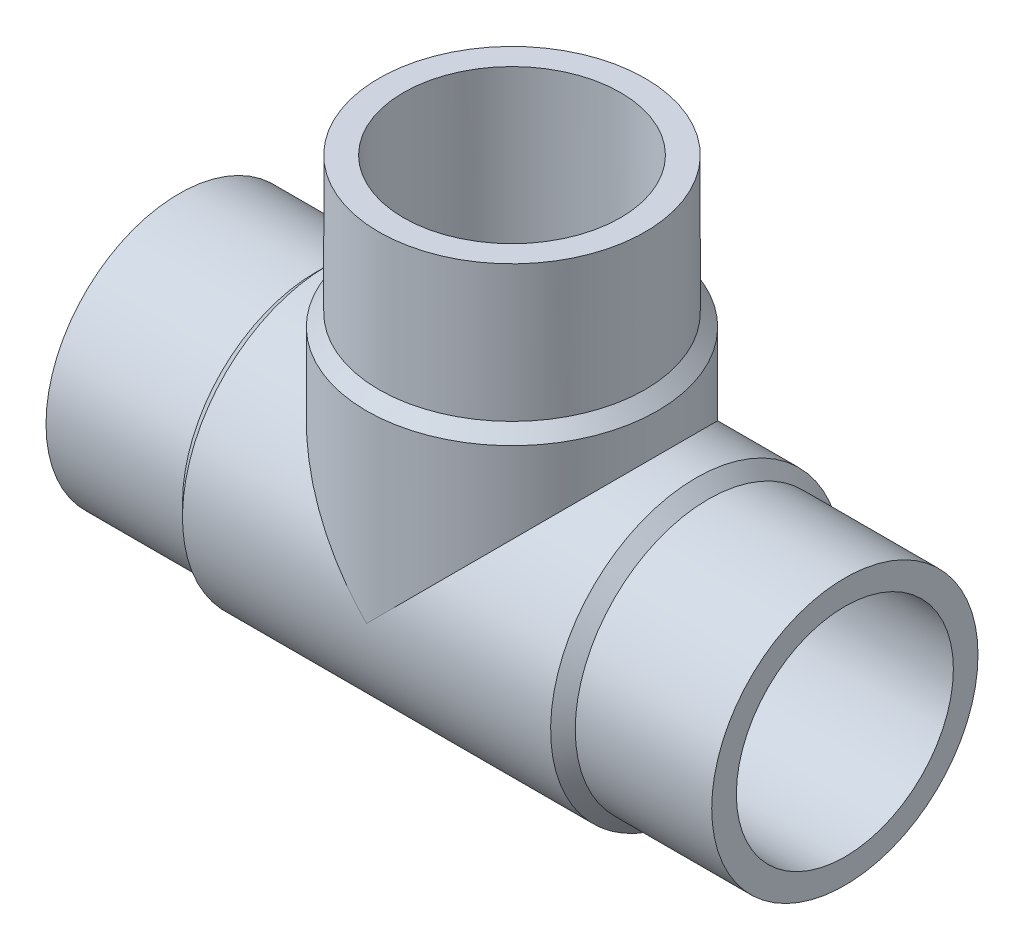
ISO-10303-21;
HEADER;
FILE_DESCRIPTION(('STEP AP214'),'2;1');
FILE_NAME('part.step','',(''),(''),'','','');
FILE_SCHEMA(('AUTOMOTIVE_DESIGN { 1 0 10303 214 1 1 1 1 }'));
ENDSEC;
DATA;
#1=APPLICATION_CONTEXT('core data for automotive mechanical design processes');
#2=APPLICATION_PROTOCOL_DEFINITION('international standard','automotive_design',2000,#1);
#3=PRODUCT_CONTEXT('',#1,'mechanical');
#4=PRODUCT('Part','Part','',(#3));
#5=PRODUCT_RELATED_PRODUCT_CATEGORY('part','',(#4));
#6=PRODUCT_DEFINITION_FORMATION('','',#4);
#7=PRODUCT_DEFINITION_CONTEXT('part definition',#1,'design');
#8=PRODUCT_DEFINITION('design','',#6,#7);
#9=PRODUCT_DEFINITION_SHAPE('','',#8);
#10=(LENGTH_UNIT() NAMED_UNIT(*) SI_UNIT(.MILLI.,.METRE.));
#11=(NAMED_UNIT(*) PLANE_ANGLE_UNIT() SI_UNIT($,.RADIAN.));
#12=(NAMED_UNIT(*) SI_UNIT($,.STERADIAN.) SOLID_ANGLE_UNIT());
#13=UNCERTAINTY_MEASURE_WITH_UNIT(LENGTH_MEASURE(1.E-05),#10,'distance_accuracy_value','');
#14=(GEOMETRIC_REPRESENTATION_CONTEXT(3) GLOBAL_UNCERTAINTY_ASSIGNED_CONTEXT((#13)) GLOBAL_UNIT_ASSIGNED_CONTEXT((#10,
#11,#12)) REPRESENTATION_CONTEXT('',''));
#15=CARTESIAN_POINT('',(0.,0.,0.));
#16=DIRECTION('',(0.,0.,1.));
#17=DIRECTION('',(1.,0.,0.));
#18=AXIS2_PLACEMENT_3D('',#15,#16,#17);
#19=CARTESIAN_POINT('',(-50.,50.,0.));
#20=DIRECTION('',(0.,1.,0.));
#21=DIRECTION('',(0.,0.,1.));
#22=AXIS2_PLACEMENT_3D('',#19,#20,#21);
#23=CYLINDRICAL_SURFACE('',#22,20.);
#24=CARTESIAN_POINT('',(-50.,50.,0.));
#25=DIRECTION('',(0.,1.,0.));
#26=DIRECTION('',(0.,0.,1.));
#27=AXIS2_PLACEMENT_3D('',#24,#25,#26);
#28=CIRCLE('',#27,20.);
#29=CARTESIAN_POINT('',(-50.,50.,20.));
#30=VERTEX_POINT('',#29);
#31=EDGE_CURVE('E18',#30,#30,#28,.T.);
#32=ORIENTED_EDGE('',*,*,#31,.F.);
#33=EDGE_LOOP('',(#32));
#34=FACE_BOUND('',#33,.T.);
#35=CARTESIAN_POINT('',(-50.,29.5,0.));
#36=DIRECTION('',(0.,1.,0.));
#37=DIRECTION('',(1.,0.,0.));
#38=AXIS2_PLACEMENT_3D('',#35,#36,#37);
#39=CIRCLE('',#38,20.);
#40=CARTESIAN_POINT('',(-30.,29.5,0.));
#41=VERTEX_POINT('',#40);
#42=EDGE_CURVE('E71',#41,#41,#39,.F.);
#43=ORIENTED_EDGE('',*,*,#42,.F.);
#44=EDGE_LOOP('',(#43));
#45=FACE_BOUND('',#44,.T.);
#46=ADVANCED_FACE('F15',(#34,#45),#23,.T.);
#47=CARTESIAN_POINT('',(-50.,29.5,0.));
#48=DIRECTION('',(0.,-1.,0.));
#49=DIRECTION('',(0.,0.,-1.));
#50=AXIS2_PLACEMENT_3D('',#47,#48,#49);
#51=CONICAL_SURFACE('',#50,20.,0.785398163397444);
#52=CARTESIAN_POINT('',(-50.,27.65,0.));
#53=DIRECTION('',(0.,1.,0.));
#54=DIRECTION('',(1.,0.,0.));
#55=AXIS2_PLACEMENT_3D('',#52,#53,#54);
#56=CIRCLE('',#55,21.85);
#57=CARTESIAN_POINT('',(-28.15,27.65,0.));
#58=VERTEX_POINT('',#57);
#59=EDGE_CURVE('E60',#58,#58,#56,.F.);
#60=ORIENTED_EDGE('',*,*,#59,.F.);
#61=EDGE_LOOP('',(#60));
#62=FACE_BOUND('',#61,.T.);
#63=ORIENTED_EDGE('',*,*,#42,.T.);
#64=EDGE_LOOP('',(#63));
#65=FACE_BOUND('',#64,.T.);
#66=ADVANCED_FACE('F141',(#62,#65),#51,.T.);
#67=CARTESIAN_POINT('',(-20.5,0.,0.));
#68=DIRECTION('',(-1.,0.,0.));
#69=DIRECTION('',(0.,0.,1.));
#70=AXIS2_PLACEMENT_3D('',#67,#68,#69);
#71=CYLINDRICAL_SURFACE('',#70,20.);
#72=CARTESIAN_POINT('',(-20.5,0.,0.));
#73=DIRECTION('',(1.,0.,0.));
#74=DIRECTION('',(0.,1.,0.));
#75=AXIS2_PLACEMENT_3D('',#72,#73,#74);
#76=CIRCLE('',#75,20.);
#77=CARTESIAN_POINT('',(-20.5,20.,0.));
#78=VERTEX_POINT('',#77);
#79=EDGE_CURVE('E64',#78,#78,#76,.F.);
#80=ORIENTED_EDGE('',*,*,#79,.F.);
#81=EDGE_LOOP('',(#80));
#82=FACE_BOUND('',#81,.T.);
#83=CARTESIAN_POINT('',(0.,0.,0.));
#84=DIRECTION('',(-1.,0.,0.));
#85=DIRECTION('',(0.,0.,1.));
#86=AXIS2_PLACEMENT_3D('',#83,#84,#85);
#87=CIRCLE('',#86,20.);
#88=CARTESIAN_POINT('',(0.,0.,20.));
#89=VERTEX_POINT('',#88);
#90=EDGE_CURVE('E58',#89,#89,#87,.F.);
#91=ORIENTED_EDGE('',*,*,#90,.F.);
#92=EDGE_LOOP('',(#91));
#93=FACE_BOUND('',#92,.T.);
#94=ADVANCED_FACE('F136',(#82,#93),#71,.T.);
#95=CARTESIAN_POINT('',(-70.,50.,20.2400021083312));
#96=DIRECTION('',(0.,1.,0.));
#97=DIRECTION('',(1.,0.,0.));
#98=AXIS2_PLACEMENT_3D('',#95,#96,#97);
#99=PLANE('',#98);
#100=CARTESIAN_POINT('',(-50.,50.,0.));
#101=DIRECTION('',(0.,1.,0.));
#102=DIRECTION('',(0.,0.,1.));
#103=AXIS2_PLACEMENT_3D('',#100,#101,#102);
#104=CIRCLE('',#103,16.3);
#105=CARTESIAN_POINT('',(-50.,50.,16.3));
#106=VERTEX_POINT('',#105);
#107=EDGE_CURVE('E52',#106,#106,#104,.T.);
#108=ORIENTED_EDGE('',*,*,#107,.F.);
#109=EDGE_LOOP('',(#108));
#110=FACE_BOUND('',#109,.T.);
#111=ORIENTED_EDGE('',*,*,#31,.T.);
#112=EDGE_LOOP('',(#111));
#113=FACE_BOUND('',#112,.T.);
#114=ADVANCED_FACE('F130',(#110,#113),#99,.T.);
#115=CARTESIAN_POINT('',(-20.5,0.,0.));
#116=DIRECTION('',(-1.,0.,0.));
#117=DIRECTION('',(0.,0.,1.));
#118=AXIS2_PLACEMENT_3D('',#115,#116,#117);
#119=CONICAL_SURFACE('',#118,20.,0.785398163397443);
#120=ORIENTED_EDGE('',*,*,#79,.T.);
#121=EDGE_LOOP('',(#120));
#122=FACE_BOUND('',#121,.T.);
#123=CARTESIAN_POINT('',(-22.35,0.,0.));
#124=DIRECTION('',(-1.,0.,0.));
#125=DIRECTION('',(0.,1.,0.));
#126=AXIS2_PLACEMENT_3D('',#123,#124,#125);
#127=CIRCLE('',#126,21.85);
#128=CARTESIAN_POINT('',(-22.35,21.85,0.));
#129=VERTEX_POINT('',#128);
#130=EDGE_CURVE('E49',#129,#129,#127,.T.);
#131=ORIENTED_EDGE('',*,*,#130,.F.);
#132=EDGE_LOOP('',(#131));
#133=FACE_BOUND('',#132,.T.);
#134=ADVANCED_FACE('F95',(#122,#133),#119,.T.);
#135=CARTESIAN_POINT('',(-50.,27.65,0.));
#136=DIRECTION('',(0.,1.,0.));
#137=DIRECTION('',(0.,0.,1.));
#138=AXIS2_PLACEMENT_3D('',#135,#136,#137);
#139=CYLINDRICAL_SURFACE('',#138,21.85);
#140=CARTESIAN_POINT('',(-50.,0.,0.));
#141=DIRECTION('',(0.707106781186547,0.707106781186547,0.));
#142=DIRECTION('',(-0.707106781186547,0.707106781186547,0.));
#143=AXIS2_PLACEMENT_3D('',#140,#141,#142);
#144=ELLIPSE('',#143,30.9005663378521,21.85);
#145=CARTESIAN_POINT('',(-50.,0.,21.85));
#146=VERTEX_POINT('',#145);
#147=CARTESIAN_POINT('',(-50.,0.,-21.85));
#148=VERTEX_POINT('',#147);
#149=EDGE_CURVE('E44',#146,#148,#144,.F.);
#150=ORIENTED_EDGE('',*,*,#149,.F.);
#151=CARTESIAN_POINT('',(-50.,0.,0.));
#152=DIRECTION('',(-0.707106781186547,0.707106781186547,0.));
#153=DIRECTION('',(0.707106781186547,0.707106781186547,0.));
#154=AXIS2_PLACEMENT_3D('',#151,#152,#153);
#155=ELLIPSE('',#154,30.9005663378521,21.85);
#156=EDGE_CURVE('E40',#148,#146,#155,.F.);
#157=ORIENTED_EDGE('',*,*,#156,.F.);
#158=EDGE_LOOP('',(#150,#157));
#159=FACE_BOUND('',#158,.T.);
#160=ORIENTED_EDGE('',*,*,#59,.T.);
#161=EDGE_LOOP('',(#160));
#162=FACE_BOUND('',#161,.T.);
#163=ADVANCED_FACE('F47',(#159,#162),#139,.T.);
#164=CARTESIAN_POINT('',(0.,20.,20.2400021083974));
#165=DIRECTION('',(1.,0.,0.));
#166=DIRECTION('',(0.,-1.,0.));
#167=AXIS2_PLACEMENT_3D('',#164,#165,#166);
#168=PLANE('',#167);
#169=CARTESIAN_POINT('',(0.,0.,0.));
#170=DIRECTION('',(-1.,0.,0.));
#171=DIRECTION('',(0.,0.,1.));
#172=AXIS2_PLACEMENT_3D('',#169,#170,#171);
#173=CIRCLE('',#172,16.3);
#174=CARTESIAN_POINT('',(0.,0.,16.3));
#175=VERTEX_POINT('',#174);
#176=EDGE_CURVE('E45',#175,#175,#173,.F.);
#177=ORIENTED_EDGE('',*,*,#176,.F.);
#178=EDGE_LOOP('',(#177));
#179=FACE_BOUND('',#178,.T.);
#180=ORIENTED_EDGE('',*,*,#90,.T.);
#181=EDGE_LOOP('',(#180));
#182=FACE_BOUND('',#181,.T.);
#183=ADVANCED_FACE('F85',(#179,#182),#168,.T.);
#184=CARTESIAN_POINT('',(-50.,0.,0.));
#185=DIRECTION('',(0.,1.,0.));
#186=DIRECTION('',(0.,0.,1.));
#187=AXIS2_PLACEMENT_3D('',#184,#185,#186);
#188=CYLINDRICAL_SURFACE('',#187,16.3);
#189=CARTESIAN_POINT('',(-50.,0.,0.));
#190=DIRECTION('',(-0.707106781186547,-0.707106781186547,0.));
#191=DIRECTION('',(-0.707106781186547,0.707106781186547,0.));
#192=AXIS2_PLACEMENT_3D('',#189,#190,#191);
#193=ELLIPSE('',#192,23.0516810666815,16.3);
#194=CARTESIAN_POINT('',(-50.,0.,-16.3));
#195=VERTEX_POINT('',#194);
#196=CARTESIAN_POINT('',(-50.,0.,16.3));
#197=VERTEX_POINT('',#196);
#198=EDGE_CURVE('E78',#195,#197,#193,.F.);
#199=ORIENTED_EDGE('',*,*,#198,.F.);
#200=CARTESIAN_POINT('',(-50.,0.,0.));
#201=DIRECTION('',(-0.707106781186547,0.707106781186547,0.));
#202=DIRECTION('',(0.707106781186547,0.707106781186547,0.));
#203=AXIS2_PLACEMENT_3D('',#200,#201,#202);
#204=ELLIPSE('',#203,23.0516810666815,16.3);
#205=EDGE_CURVE('E32',#195,#197,#204,.F.);
#206=ORIENTED_EDGE('',*,*,#205,.T.);
#207=EDGE_LOOP('',(#199,#206));
#208=FACE_BOUND('',#207,.T.);
#209=ORIENTED_EDGE('',*,*,#107,.T.);
#210=EDGE_LOOP('',(#209));
#211=FACE_BOUND('',#210,.T.);
#212=ADVANCED_FACE('F87',(#208,#211),#188,.F.);
#213=CARTESIAN_POINT('',(-77.65,0.,0.));
#214=DIRECTION('',(-1.,0.,0.));
#215=DIRECTION('',(0.,0.,1.));
#216=AXIS2_PLACEMENT_3D('',#213,#214,#215);
#217=CYLINDRICAL_SURFACE('',#216,21.85);
#218=ORIENTED_EDGE('',*,*,#130,.T.);
#219=EDGE_LOOP('',(#218));
#220=FACE_BOUND('',#219,.T.);
#221=CARTESIAN_POINT('',(-77.65,0.,0.));
#222=DIRECTION('',(-1.,0.,0.));
#223=DIRECTION('',(0.,1.,0.));
#224=AXIS2_PLACEMENT_3D('',#221,#222,#223);
#225=CIRCLE('',#224,21.85);
#226=CARTESIAN_POINT('',(-77.65,21.85,0.));
#227=VERTEX_POINT('',#226);
#228=EDGE_CURVE('E77',#227,#227,#225,.T.);
#229=ORIENTED_EDGE('',*,*,#228,.F.);
#230=EDGE_LOOP('',(#229));
#231=FACE_BOUND('',#230,.T.);
#232=ORIENTED_EDGE('',*,*,#149,.T.);
#233=ORIENTED_EDGE('',*,*,#156,.T.);
#234=EDGE_LOOP('',(#232,#233));
#235=FACE_BOUND('',#234,.T.);
#236=ADVANCED_FACE('F43',(#220,#231,#235),#217,.T.);
#237=CARTESIAN_POINT('',(-50.,0.,0.));
#238=DIRECTION('',(-1.,0.,0.));
#239=DIRECTION('',(0.,0.,1.));
#240=AXIS2_PLACEMENT_3D('',#237,#238,#239);
#241=CYLINDRICAL_SURFACE('',#240,16.3);
#242=ORIENTED_EDGE('',*,*,#205,.F.);
#243=ORIENTED_EDGE('',*,*,#198,.T.);
#244=EDGE_LOOP('',(#242,#243));
#245=FACE_BOUND('',#244,.T.);
#246=ORIENTED_EDGE('',*,*,#176,.T.);
#247=EDGE_LOOP('',(#246));
#248=FACE_BOUND('',#247,.T.);
#249=CARTESIAN_POINT('',(-100.,0.,0.));
#250=DIRECTION('',(-1.,0.,0.));
#251=DIRECTION('',(0.,0.,1.));
#252=AXIS2_PLACEMENT_3D('',#249,#250,#251);
#253=CIRCLE('',#252,16.3);
#254=CARTESIAN_POINT('',(-100.,0.,16.3));
#255=VERTEX_POINT('',#254);
#256=EDGE_CURVE('E74',#255,#255,#253,.F.);
#257=ORIENTED_EDGE('',*,*,#256,.F.);
#258=EDGE_LOOP('',(#257));
#259=FACE_BOUND('',#258,.T.);
#260=ADVANCED_FACE('F82',(#245,#248,#259),#241,.F.);
#261=CARTESIAN_POINT('',(-79.5,0.,0.));
#262=DIRECTION('',(1.,0.,0.));
#263=DIRECTION('',(0.,0.,-1.));
#264=AXIS2_PLACEMENT_3D('',#261,#262,#263);
#265=CONICAL_SURFACE('',#264,20.,0.78539816339744);
#266=ORIENTED_EDGE('',*,*,#228,.T.);
#267=EDGE_LOOP('',(#266));
#268=FACE_BOUND('',#267,.T.);
#269=CARTESIAN_POINT('',(-79.5,0.,0.));
#270=DIRECTION('',(-1.,0.,0.));
#271=DIRECTION('',(0.,1.,0.));
#272=AXIS2_PLACEMENT_3D('',#269,#270,#271);
#273=CIRCLE('',#272,20.);
#274=CARTESIAN_POINT('',(-79.5,20.,0.));
#275=VERTEX_POINT('',#274);
#276=EDGE_CURVE('E24',#275,#275,#273,.T.);
#277=ORIENTED_EDGE('',*,*,#276,.F.);
#278=EDGE_LOOP('',(#277));
#279=FACE_BOUND('',#278,.T.);
#280=ADVANCED_FACE('F105',(#268,#279),#265,.T.);
#281=CARTESIAN_POINT('',(-100.,-20.,20.2400021083327));
#282=DIRECTION('',(-1.,0.,0.));
#283=DIRECTION('',(0.,1.,0.));
#284=AXIS2_PLACEMENT_3D('',#281,#282,#283);
#285=PLANE('',#284);
#286=ORIENTED_EDGE('',*,*,#256,.T.);
#287=EDGE_LOOP('',(#286));
#288=FACE_BOUND('',#287,.T.);
#289=CARTESIAN_POINT('',(-100.,0.,0.));
#290=DIRECTION('',(-1.,0.,0.));
#291=DIRECTION('',(0.,0.,1.));
#292=AXIS2_PLACEMENT_3D('',#289,#290,#291);
#293=CIRCLE('',#292,20.);
#294=CARTESIAN_POINT('',(-100.,0.,20.));
#295=VERTEX_POINT('',#294);
#296=EDGE_CURVE('E9',#295,#295,#293,.F.);
#297=ORIENTED_EDGE('',*,*,#296,.F.);
#298=EDGE_LOOP('',(#297));
#299=FACE_BOUND('',#298,.T.);
#300=ADVANCED_FACE('F99',(#288,#299),#285,.T.);
#301=CARTESIAN_POINT('',(-100.,0.,0.));
#302=DIRECTION('',(-1.,0.,0.));
#303=DIRECTION('',(0.,0.,1.));
#304=AXIS2_PLACEMENT_3D('',#301,#302,#303);
#305=CYLINDRICAL_SURFACE('',#304,20.);
#306=ORIENTED_EDGE('',*,*,#276,.T.);
#307=EDGE_LOOP('',(#306));
#308=FACE_BOUND('',#307,.T.);
#309=ORIENTED_EDGE('',*,*,#296,.T.);
#310=EDGE_LOOP('',(#309));
#311=FACE_BOUND('',#310,.T.);
#312=ADVANCED_FACE('F97',(#308,#311),#305,.T.);
#313=CLOSED_SHELL('',(#46,#66,#94,#114,#134,#163,#183,#212,#236,#260,#280,#300,#312));
#314=MANIFOLD_SOLID_BREP('B1',#313);
#315=ADVANCED_BREP_SHAPE_REPRESENTATION('',(#18,#314),#14);
#316=SHAPE_DEFINITION_REPRESENTATION(#9,#315);
ENDSEC;
END-ISO-10303-21;
